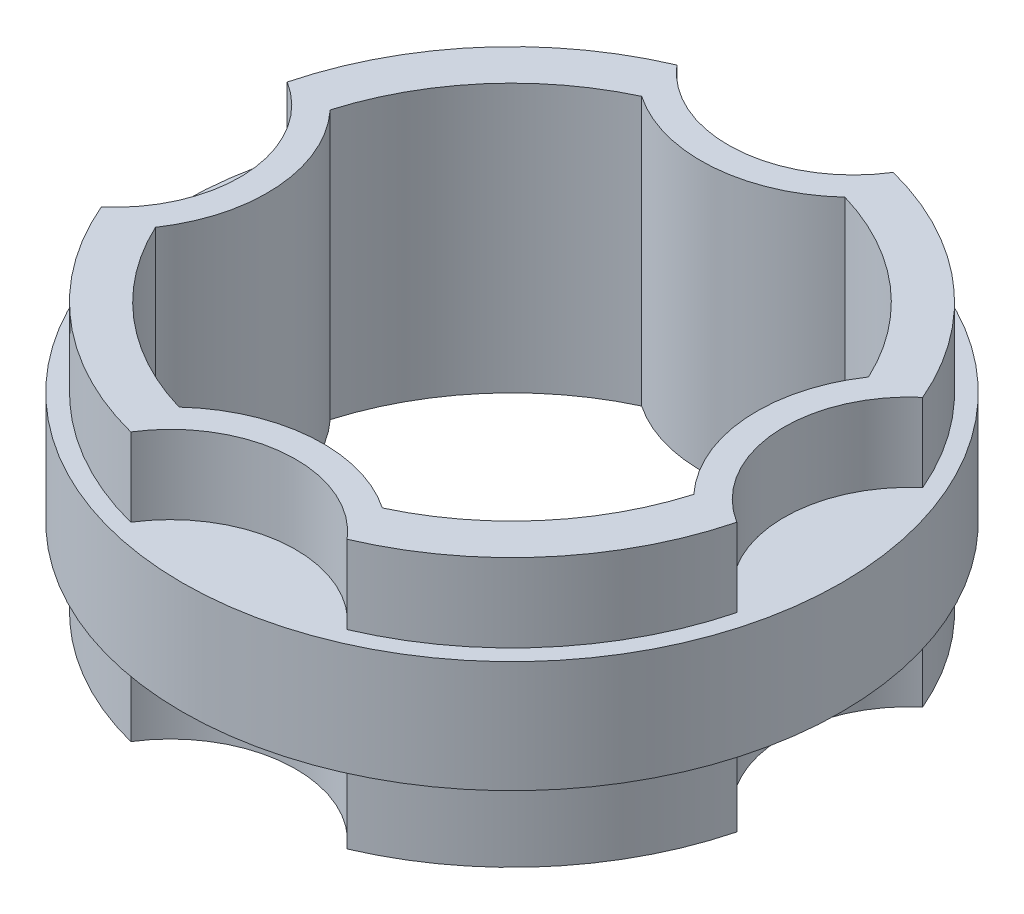
ISO-10303-21;
HEADER;
FILE_DESCRIPTION(('STEP AP214'),'2;1');
FILE_NAME('part.step','',(''),(''),'','','');
FILE_SCHEMA(('AUTOMOTIVE_DESIGN { 1 0 10303 214 1 1 1 1 }'));
ENDSEC;
DATA;
#1=APPLICATION_CONTEXT('core data for automotive mechanical design processes');
#2=APPLICATION_PROTOCOL_DEFINITION('international standard','automotive_design',2000,#1);
#3=PRODUCT_CONTEXT('',#1,'mechanical');
#4=PRODUCT('Part','Part','',(#3));
#5=PRODUCT_RELATED_PRODUCT_CATEGORY('part','',(#4));
#6=PRODUCT_DEFINITION_FORMATION('','',#4);
#7=PRODUCT_DEFINITION_CONTEXT('part definition',#1,'design');
#8=PRODUCT_DEFINITION('design','',#6,#7);
#9=PRODUCT_DEFINITION_SHAPE('','',#8);
#10=(LENGTH_UNIT() NAMED_UNIT(*) SI_UNIT(.MILLI.,.METRE.));
#11=(NAMED_UNIT(*) PLANE_ANGLE_UNIT() SI_UNIT($,.RADIAN.));
#12=(NAMED_UNIT(*) SI_UNIT($,.STERADIAN.) SOLID_ANGLE_UNIT());
#13=UNCERTAINTY_MEASURE_WITH_UNIT(LENGTH_MEASURE(1.E-05),#10,'distance_accuracy_value','');
#14=(GEOMETRIC_REPRESENTATION_CONTEXT(3) GLOBAL_UNCERTAINTY_ASSIGNED_CONTEXT((#13)) GLOBAL_UNIT_ASSIGNED_CONTEXT((#10,
#11,#12)) REPRESENTATION_CONTEXT('',''));
#15=CARTESIAN_POINT('',(0.,0.,0.));
#16=DIRECTION('',(0.,0.,1.));
#17=DIRECTION('',(1.,0.,0.));
#18=AXIS2_PLACEMENT_3D('',#15,#16,#17);
#19=CARTESIAN_POINT('',(104.92721593541,-44.5241872410913,-7.94005837170104));
#20=DIRECTION('',(0.,1.,0.));
#21=DIRECTION('',(0.,0.,1.));
#22=AXIS2_PLACEMENT_3D('',#19,#20,#21);
#23=CYLINDRICAL_SURFACE('',#22,35.5704838142581);
#24=CARTESIAN_POINT('',(104.92721593541,15.875,-7.94005837170104));
#25=DIRECTION('',(0.,1.,0.));
#26=DIRECTION('',(0.,0.,1.));
#27=AXIS2_PLACEMENT_3D('',#24,#25,#26);
#28=CIRCLE('',#27,35.5704838142581);
#29=CARTESIAN_POINT('',(86.0770548694598,15.875,22.225));
#30=VERTEX_POINT('',#29);
#31=CARTESIAN_POINT('',(81.7523967538567,15.875,-34.925));
#32=VERTEX_POINT('',#31);
#33=EDGE_CURVE('E294',#30,#32,#28,.F.);
#34=ORIENTED_EDGE('',*,*,#33,.T.);
#35=DIRECTION('',(0.,1.,0.));
#36=VECTOR('',#35,1.);
#37=CARTESIAN_POINT('',(81.7523967538567,-44.5241872410913,-34.925));
#38=LINE('',#37,#36);
#39=CARTESIAN_POINT('',(81.7523967538567,38.1,-34.925));
#40=VERTEX_POINT('',#39);
#41=EDGE_CURVE('E260',#32,#40,#38,.T.);
#42=ORIENTED_EDGE('',*,*,#41,.T.);
#43=CARTESIAN_POINT('',(104.92721593541,38.1,-7.94005837170104));
#44=DIRECTION('',(0.,1.,0.));
#45=DIRECTION('',(0.,0.,1.));
#46=AXIS2_PLACEMENT_3D('',#43,#44,#45);
#47=CIRCLE('',#46,35.5704838142581);
#48=CARTESIAN_POINT('',(86.0770548694598,38.1,22.225));
#49=VERTEX_POINT('',#48);
#50=EDGE_CURVE('E262',#40,#49,#47,.T.);
#51=ORIENTED_EDGE('',*,*,#50,.T.);
#52=DIRECTION('',(0.,1.,0.));
#53=VECTOR('',#52,1.);
#54=CARTESIAN_POINT('',(86.0770548694598,-44.5241872410913,22.225));
#55=LINE('',#54,#53);
#56=EDGE_CURVE('E257',#30,#49,#55,.T.);
#57=ORIENTED_EDGE('',*,*,#56,.F.);
#58=EDGE_LOOP('',(#34,#42,#51,#57));
#59=FACE_BOUND('',#58,.T.);
#60=ADVANCED_FACE('F34',(#59),#23,.F.);
#61=DIRECTION('',(0.,-1.,0.));
#62=VECTOR('',#61,1.);
#63=CARTESIAN_POINT('',(81.7523967538567,76.2741872410913,-34.925));
#64=LINE('',#63,#62);
#65=CARTESIAN_POINT('',(81.7523967538567,-15.875,-34.925));
#66=VERTEX_POINT('',#65);
#67=CARTESIAN_POINT('',(81.7523967538567,-38.1,-34.925));
#68=VERTEX_POINT('',#67);
#69=EDGE_CURVE('E321',#66,#68,#64,.T.);
#70=ORIENTED_EDGE('',*,*,#69,.F.);
#71=CARTESIAN_POINT('',(104.92721593541,-15.875,-7.94005837170104));
#72=DIRECTION('',(0.,1.,0.));
#73=DIRECTION('',(0.,0.,1.));
#74=AXIS2_PLACEMENT_3D('',#71,#72,#73);
#75=CIRCLE('',#74,35.5704838142581);
#76=CARTESIAN_POINT('',(86.0770548694598,-15.875,22.225));
#77=VERTEX_POINT('',#76);
#78=EDGE_CURVE('E333',#77,#66,#75,.F.);
#79=ORIENTED_EDGE('',*,*,#78,.F.);
#80=DIRECTION('',(0.,-1.,0.));
#81=VECTOR('',#80,1.);
#82=CARTESIAN_POINT('',(86.0770548694598,76.2741872410913,22.225));
#83=LINE('',#82,#81);
#84=CARTESIAN_POINT('',(86.0770548694598,-38.1,22.225));
#85=VERTEX_POINT('',#84);
#86=EDGE_CURVE('E318',#77,#85,#83,.T.);
#87=ORIENTED_EDGE('',*,*,#86,.T.);
#88=CARTESIAN_POINT('',(104.92721593541,-38.1,-7.94005837170104));
#89=DIRECTION('',(0.,1.,0.));
#90=DIRECTION('',(0.,0.,1.));
#91=AXIS2_PLACEMENT_3D('',#88,#89,#90);
#92=CIRCLE('',#91,35.5704838142581);
#93=EDGE_CURVE('E275',#68,#85,#92,.T.);
#94=ORIENTED_EDGE('',*,*,#93,.F.);
#95=EDGE_LOOP('',(#70,#79,#87,#94));
#96=FACE_BOUND('',#95,.T.);
#97=ADVANCED_FACE('F397',(#96),#23,.F.);
#98=CARTESIAN_POINT('',(-7.94005837169994,-44.5241872410913,-104.92721593541));
#99=DIRECTION('',(0.,1.,0.));
#100=DIRECTION('',(0.,0.,1.));
#101=AXIS2_PLACEMENT_3D('',#98,#99,#100);
#102=CYLINDRICAL_SURFACE('',#101,35.5704838142581);
#103=CARTESIAN_POINT('',(-7.94005837169994,15.875,-104.92721593541));
#104=DIRECTION('',(0.,1.,0.));
#105=DIRECTION('',(0.,0.,1.));
#106=AXIS2_PLACEMENT_3D('',#103,#104,#105);
#107=CIRCLE('',#106,35.5704838142581);
#108=CARTESIAN_POINT('',(22.2250000000009,15.875,-86.0770548694596));
#109=VERTEX_POINT('',#108);
#110=CARTESIAN_POINT('',(-34.9249999999991,15.875,-81.7523967538571));
#111=VERTEX_POINT('',#110);
#112=EDGE_CURVE('E327',#109,#111,#107,.F.);
#113=ORIENTED_EDGE('',*,*,#112,.T.);
#114=DIRECTION('',(0.,1.,0.));
#115=VECTOR('',#114,1.);
#116=CARTESIAN_POINT('',(-34.9249999999991,-44.5241872410913,-81.7523967538571));
#117=LINE('',#116,#115);
#118=CARTESIAN_POINT('',(-34.9249999999991,38.1,-81.7523967538571));
#119=VERTEX_POINT('',#118);
#120=EDGE_CURVE('E267',#111,#119,#117,.T.);
#121=ORIENTED_EDGE('',*,*,#120,.T.);
#122=CARTESIAN_POINT('',(-7.94005837169994,38.1,-104.92721593541));
#123=DIRECTION('',(0.,1.,0.));
#124=DIRECTION('',(1.,0.,0.));
#125=AXIS2_PLACEMENT_3D('',#122,#123,#124);
#126=CIRCLE('',#125,35.5704838142581);
#127=CARTESIAN_POINT('',(22.2250000000009,38.1,-86.0770548694596));
#128=VERTEX_POINT('',#127);
#129=EDGE_CURVE('E270',#119,#128,#126,.T.);
#130=ORIENTED_EDGE('',*,*,#129,.T.);
#131=DIRECTION('',(0.,1.,0.));
#132=VECTOR('',#131,1.);
#133=CARTESIAN_POINT('',(22.2250000000009,-44.5241872410913,-86.0770548694596));
#134=LINE('',#133,#132);
#135=EDGE_CURVE('E269',#109,#128,#134,.T.);
#136=ORIENTED_EDGE('',*,*,#135,.F.);
#137=EDGE_LOOP('',(#113,#121,#130,#136));
#138=FACE_BOUND('',#137,.T.);
#139=ADVANCED_FACE('F403',(#138),#102,.F.);
#140=DIRECTION('',(0.,-1.,0.));
#141=VECTOR('',#140,1.);
#142=CARTESIAN_POINT('',(-34.9249999999991,76.2741872410913,-81.7523967538571));
#143=LINE('',#142,#141);
#144=CARTESIAN_POINT('',(-34.9249999999991,-15.875,-81.7523967538571));
#145=VERTEX_POINT('',#144);
#146=CARTESIAN_POINT('',(-34.9249999999991,-38.1,-81.7523967538571));
#147=VERTEX_POINT('',#146);
#148=EDGE_CURVE('E293',#145,#147,#143,.T.);
#149=ORIENTED_EDGE('',*,*,#148,.F.);
#150=CARTESIAN_POINT('',(-7.94005837169994,-15.875,-104.92721593541));
#151=DIRECTION('',(0.,1.,0.));
#152=DIRECTION('',(0.,0.,1.));
#153=AXIS2_PLACEMENT_3D('',#150,#151,#152);
#154=CIRCLE('',#153,35.5704838142581);
#155=CARTESIAN_POINT('',(22.2250000000009,-15.875,-86.0770548694596));
#156=VERTEX_POINT('',#155);
#157=EDGE_CURVE('E335',#156,#145,#154,.F.);
#158=ORIENTED_EDGE('',*,*,#157,.F.);
#159=DIRECTION('',(0.,-1.,0.));
#160=VECTOR('',#159,1.);
#161=CARTESIAN_POINT('',(22.2250000000009,76.2741872410913,-86.0770548694596));
#162=LINE('',#161,#160);
#163=CARTESIAN_POINT('',(22.2250000000009,-38.1,-86.0770548694596));
#164=VERTEX_POINT('',#163);
#165=EDGE_CURVE('E290',#156,#164,#162,.T.);
#166=ORIENTED_EDGE('',*,*,#165,.T.);
#167=CARTESIAN_POINT('',(-7.94005837169994,-38.1,-104.92721593541));
#168=DIRECTION('',(0.,1.,0.));
#169=DIRECTION('',(1.,0.,0.));
#170=AXIS2_PLACEMENT_3D('',#167,#168,#169);
#171=CIRCLE('',#170,35.5704838142581);
#172=EDGE_CURVE('E297',#147,#164,#171,.T.);
#173=ORIENTED_EDGE('',*,*,#172,.F.);
#174=EDGE_LOOP('',(#149,#158,#166,#173));
#175=FACE_BOUND('',#174,.T.);
#176=ADVANCED_FACE('F490',(#175),#102,.F.);
#177=CARTESIAN_POINT('',(-104.92721593541,-44.5241872410913,7.94005837170104));
#178=DIRECTION('',(0.,1.,0.));
#179=DIRECTION('',(0.,0.,1.));
#180=AXIS2_PLACEMENT_3D('',#177,#178,#179);
#181=CYLINDRICAL_SURFACE('',#180,35.5704838142581);
#182=CARTESIAN_POINT('',(-104.92721593541,15.875,7.94005837170104));
#183=DIRECTION('',(0.,1.,0.));
#184=DIRECTION('',(0.,0.,1.));
#185=AXIS2_PLACEMENT_3D('',#182,#183,#184);
#186=CIRCLE('',#185,35.5704838142581);
#187=CARTESIAN_POINT('',(-86.0770548694598,15.875,-22.225));
#188=VERTEX_POINT('',#187);
#189=CARTESIAN_POINT('',(-81.7523967538567,15.875,34.925));
#190=VERTEX_POINT('',#189);
#191=EDGE_CURVE('E329',#188,#190,#186,.F.);
#192=ORIENTED_EDGE('',*,*,#191,.T.);
#193=DIRECTION('',(0.,1.,0.));
#194=VECTOR('',#193,1.);
#195=CARTESIAN_POINT('',(-81.7523967538567,-44.5241872410913,34.925));
#196=LINE('',#195,#194);
#197=CARTESIAN_POINT('',(-81.7523967538567,38.1,34.925));
#198=VERTEX_POINT('',#197);
#199=EDGE_CURVE('E276',#190,#198,#196,.T.);
#200=ORIENTED_EDGE('',*,*,#199,.T.);
#201=CARTESIAN_POINT('',(-104.92721593541,38.1,7.94005837170104));
#202=DIRECTION('',(0.,1.,0.));
#203=DIRECTION('',(0.,0.,-1.));
#204=AXIS2_PLACEMENT_3D('',#201,#202,#203);
#205=CIRCLE('',#204,35.5704838142581);
#206=CARTESIAN_POINT('',(-86.0770548694598,38.1,-22.225));
#207=VERTEX_POINT('',#206);
#208=EDGE_CURVE('E272',#198,#207,#205,.T.);
#209=ORIENTED_EDGE('',*,*,#208,.T.);
#210=DIRECTION('',(0.,1.,0.));
#211=VECTOR('',#210,1.);
#212=CARTESIAN_POINT('',(-86.0770548694598,-44.5241872410913,-22.225));
#213=LINE('',#212,#211);
#214=EDGE_CURVE('E278',#188,#207,#213,.T.);
#215=ORIENTED_EDGE('',*,*,#214,.F.);
#216=EDGE_LOOP('',(#192,#200,#209,#215));
#217=FACE_BOUND('',#216,.T.);
#218=ADVANCED_FACE('F488',(#217),#181,.F.);
#219=DIRECTION('',(0.,-1.,0.));
#220=VECTOR('',#219,1.);
#221=CARTESIAN_POINT('',(-81.7523967538567,76.2741872410913,34.925));
#222=LINE('',#221,#220);
#223=CARTESIAN_POINT('',(-81.7523967538567,-15.875,34.925));
#224=VERTEX_POINT('',#223);
#225=CARTESIAN_POINT('',(-81.7523967538567,-38.1,34.925));
#226=VERTEX_POINT('',#225);
#227=EDGE_CURVE('E303',#224,#226,#222,.T.);
#228=ORIENTED_EDGE('',*,*,#227,.F.);
#229=CARTESIAN_POINT('',(-104.92721593541,-15.875,7.94005837170104));
#230=DIRECTION('',(0.,1.,0.));
#231=DIRECTION('',(0.,0.,1.));
#232=AXIS2_PLACEMENT_3D('',#229,#230,#231);
#233=CIRCLE('',#232,35.5704838142581);
#234=CARTESIAN_POINT('',(-86.0770548694598,-15.875,-22.225));
#235=VERTEX_POINT('',#234);
#236=EDGE_CURVE('E337',#235,#224,#233,.F.);
#237=ORIENTED_EDGE('',*,*,#236,.F.);
#238=DIRECTION('',(0.,-1.,0.));
#239=VECTOR('',#238,1.);
#240=CARTESIAN_POINT('',(-86.0770548694598,76.2741872410913,-22.225));
#241=LINE('',#240,#239);
#242=CARTESIAN_POINT('',(-86.0770548694598,-38.1,-22.225));
#243=VERTEX_POINT('',#242);
#244=EDGE_CURVE('E300',#235,#243,#241,.T.);
#245=ORIENTED_EDGE('',*,*,#244,.T.);
#246=CARTESIAN_POINT('',(-104.92721593541,-38.1,7.94005837170104));
#247=DIRECTION('',(0.,1.,0.));
#248=DIRECTION('',(0.,0.,-1.));
#249=AXIS2_PLACEMENT_3D('',#246,#247,#248);
#250=CIRCLE('',#249,35.5704838142581);
#251=EDGE_CURVE('E306',#226,#243,#250,.T.);
#252=ORIENTED_EDGE('',*,*,#251,.F.);
#253=EDGE_LOOP('',(#228,#237,#245,#252));
#254=FACE_BOUND('',#253,.T.);
#255=ADVANCED_FACE('F447',(#254),#181,.F.);
#256=CARTESIAN_POINT('',(7.94005837170067,-44.5241872410913,104.92721593541));
#257=DIRECTION('',(0.,1.,0.));
#258=DIRECTION('',(0.,0.,1.));
#259=AXIS2_PLACEMENT_3D('',#256,#257,#258);
#260=CYLINDRICAL_SURFACE('',#259,35.5704838142581);
#261=DIRECTION('',(0.,1.,0.));
#262=VECTOR('',#261,1.);
#263=CARTESIAN_POINT('',(-22.2250000000003,-44.5241872410913,86.0770548694597));
#264=LINE('',#263,#262);
#265=CARTESIAN_POINT('',(-22.2250000000003,15.875,86.0770548694597));
#266=VERTEX_POINT('',#265);
#267=CARTESIAN_POINT('',(-22.2250000000003,38.1,86.0770548694597));
#268=VERTEX_POINT('',#267);
#269=EDGE_CURVE('E266',#266,#268,#264,.T.);
#270=ORIENTED_EDGE('',*,*,#269,.F.);
#271=CARTESIAN_POINT('',(7.94005837170067,15.875,104.92721593541));
#272=DIRECTION('',(0.,1.,0.));
#273=DIRECTION('',(0.,0.,1.));
#274=AXIS2_PLACEMENT_3D('',#271,#272,#273);
#275=CIRCLE('',#274,35.5704838142581);
#276=CARTESIAN_POINT('',(34.9249999999997,15.875,81.7523967538568));
#277=VERTEX_POINT('',#276);
#278=EDGE_CURVE('E331',#266,#277,#275,.F.);
#279=ORIENTED_EDGE('',*,*,#278,.T.);
#280=DIRECTION('',(0.,1.,0.));
#281=VECTOR('',#280,1.);
#282=CARTESIAN_POINT('',(34.9249999999997,-44.5241872410913,81.7523967538568));
#283=LINE('',#282,#281);
#284=CARTESIAN_POINT('',(34.9249999999997,38.1,81.7523967538568));
#285=VERTEX_POINT('',#284);
#286=EDGE_CURVE('E284',#277,#285,#283,.T.);
#287=ORIENTED_EDGE('',*,*,#286,.T.);
#288=CARTESIAN_POINT('',(7.94005837170067,38.1,104.92721593541));
#289=DIRECTION('',(0.,1.,0.));
#290=DIRECTION('',(-1.,0.,0.));
#291=AXIS2_PLACEMENT_3D('',#288,#289,#290);
#292=CIRCLE('',#291,35.5704838142581);
#293=EDGE_CURVE('E281',#285,#268,#292,.T.);
#294=ORIENTED_EDGE('',*,*,#293,.T.);
#295=EDGE_LOOP('',(#270,#279,#287,#294));
#296=FACE_BOUND('',#295,.T.);
#297=ADVANCED_FACE('F474',(#296),#260,.F.);
#298=DIRECTION('',(0.,-1.,0.));
#299=VECTOR('',#298,1.);
#300=CARTESIAN_POINT('',(34.9249999999997,76.2741872410913,81.7523967538568));
#301=LINE('',#300,#299);
#302=CARTESIAN_POINT('',(34.9249999999997,-15.875,81.7523967538568));
#303=VERTEX_POINT('',#302);
#304=CARTESIAN_POINT('',(34.9249999999997,-38.1,81.7523967538568));
#305=VERTEX_POINT('',#304);
#306=EDGE_CURVE('E312',#303,#305,#301,.T.);
#307=ORIENTED_EDGE('',*,*,#306,.F.);
#308=CARTESIAN_POINT('',(7.94005837170067,-15.875,104.92721593541));
#309=DIRECTION('',(0.,1.,0.));
#310=DIRECTION('',(0.,0.,1.));
#311=AXIS2_PLACEMENT_3D('',#308,#309,#310);
#312=CIRCLE('',#311,35.5704838142581);
#313=CARTESIAN_POINT('',(-22.2250000000003,-15.875,86.0770548694597));
#314=VERTEX_POINT('',#313);
#315=EDGE_CURVE('E339',#314,#303,#312,.F.);
#316=ORIENTED_EDGE('',*,*,#315,.F.);
#317=DIRECTION('',(0.,-1.,0.));
#318=VECTOR('',#317,1.);
#319=CARTESIAN_POINT('',(-22.2250000000003,76.2741872410913,86.0770548694597));
#320=LINE('',#319,#318);
#321=CARTESIAN_POINT('',(-22.2250000000003,-38.1,86.0770548694597));
#322=VERTEX_POINT('',#321);
#323=EDGE_CURVE('E309',#314,#322,#320,.T.);
#324=ORIENTED_EDGE('',*,*,#323,.T.);
#325=CARTESIAN_POINT('',(7.94005837170067,-38.1,104.92721593541));
#326=DIRECTION('',(0.,1.,0.));
#327=DIRECTION('',(-1.,0.,0.));
#328=AXIS2_PLACEMENT_3D('',#325,#326,#327);
#329=CIRCLE('',#328,35.5704838142581);
#330=EDGE_CURVE('E315',#305,#322,#329,.T.);
#331=ORIENTED_EDGE('',*,*,#330,.F.);
#332=EDGE_LOOP('',(#307,#316,#324,#331));
#333=FACE_BOUND('',#332,.T.);
#334=ADVANCED_FACE('F423',(#333),#260,.F.);
#335=CARTESIAN_POINT('',(0.,38.1,0.));
#336=DIRECTION('',(0.,-1.,0.));
#337=DIRECTION('',(0.,0.,-1.));
#338=AXIS2_PLACEMENT_3D('',#335,#336,#337);
#339=CYLINDRICAL_SURFACE('',#338,76.2);
#340=CARTESIAN_POINT('',(0.,38.1,0.));
#341=DIRECTION('',(0.,1.,0.));
#342=DIRECTION('',(0.,0.,1.));
#343=AXIS2_PLACEMENT_3D('',#340,#341,#342);
#344=CIRCLE('',#343,76.2);
#345=CARTESIAN_POINT('',(32.221294795127,38.1,69.0523581184996));
#346=VERTEX_POINT('',#345);
#347=CARTESIAN_POINT('',(73.1147754744554,38.1,21.4632152139417));
#348=VERTEX_POINT('',#347);
#349=EDGE_CURVE('E222',#346,#348,#344,.T.);
#350=ORIENTED_EDGE('',*,*,#349,.T.);
#351=DIRECTION('',(0.,-1.,0.));
#352=VECTOR('',#351,1.);
#353=CARTESIAN_POINT('',(73.1147754744554,0.,21.4632152139417));
#354=LINE('',#353,#352);
#355=CARTESIAN_POINT('',(73.1147754744554,-38.1,21.4632152139417));
#356=VERTEX_POINT('',#355);
#357=EDGE_CURVE('E201',#348,#356,#354,.T.);
#358=ORIENTED_EDGE('',*,*,#357,.T.);
#359=CARTESIAN_POINT('',(0.,-38.1,0.));
#360=DIRECTION('',(0.,1.,0.));
#361=DIRECTION('',(0.,0.,1.));
#362=AXIS2_PLACEMENT_3D('',#359,#360,#361);
#363=CIRCLE('',#362,76.2);
#364=CARTESIAN_POINT('',(32.221294795127,-38.1,69.0523581184996));
#365=VERTEX_POINT('',#364);
#366=EDGE_CURVE('E227',#365,#356,#363,.T.);
#367=ORIENTED_EDGE('',*,*,#366,.F.);
#368=DIRECTION('',(0.,-1.,0.));
#369=VECTOR('',#368,1.);
#370=CARTESIAN_POINT('',(32.221294795127,0.,69.0523581184996));
#371=LINE('',#370,#369);
#372=EDGE_CURVE('E344',#365,#346,#371,.F.);
#373=ORIENTED_EDGE('',*,*,#372,.T.);
#374=EDGE_LOOP('',(#350,#358,#367,#373));
#375=FACE_BOUND('',#374,.T.);
#376=ADVANCED_FACE('F371',(#375),#339,.F.);
#377=CARTESIAN_POINT('',(69.0523581185,-38.1,-32.2212947951263));
#378=VERTEX_POINT('',#377);
#379=CARTESIAN_POINT('',(21.463215213941,-38.1,-73.1147754744556));
#380=VERTEX_POINT('',#379);
#381=EDGE_CURVE('E212',#378,#380,#363,.T.);
#382=ORIENTED_EDGE('',*,*,#381,.F.);
#383=DIRECTION('',(0.,-1.,0.));
#384=VECTOR('',#383,1.);
#385=CARTESIAN_POINT('',(69.0523581185,0.,-32.2212947951263));
#386=LINE('',#385,#384);
#387=CARTESIAN_POINT('',(69.0523581185,38.1,-32.2212947951263));
#388=VERTEX_POINT('',#387);
#389=EDGE_CURVE('E198',#378,#388,#386,.F.);
#390=ORIENTED_EDGE('',*,*,#389,.T.);
#391=CARTESIAN_POINT('',(21.463215213941,38.1,-73.1147754744556));
#392=VERTEX_POINT('',#391);
#393=EDGE_CURVE('E210',#388,#392,#344,.T.);
#394=ORIENTED_EDGE('',*,*,#393,.T.);
#395=DIRECTION('',(0.,-1.,0.));
#396=VECTOR('',#395,1.);
#397=CARTESIAN_POINT('',(21.463215213941,0.,-73.1147754744556));
#398=LINE('',#397,#396);
#399=EDGE_CURVE('E361',#392,#380,#398,.T.);
#400=ORIENTED_EDGE('',*,*,#399,.T.);
#401=EDGE_LOOP('',(#382,#390,#394,#400));
#402=FACE_BOUND('',#401,.T.);
#403=ADVANCED_FACE('F208',(#402),#339,.F.);
#404=CARTESIAN_POINT('',(-32.221294795127,-38.1,-69.0523581184996));
#405=VERTEX_POINT('',#404);
#406=CARTESIAN_POINT('',(-73.1147754744555,-38.1,-21.4632152139412));
#407=VERTEX_POINT('',#406);
#408=EDGE_CURVE('E232',#405,#407,#363,.T.);
#409=ORIENTED_EDGE('',*,*,#408,.F.);
#410=DIRECTION('',(0.,-1.,0.));
#411=VECTOR('',#410,1.);
#412=CARTESIAN_POINT('',(-32.221294795127,0.,-69.0523581184996));
#413=LINE('',#412,#411);
#414=CARTESIAN_POINT('',(-32.221294795127,38.1,-69.0523581184996));
#415=VERTEX_POINT('',#414);
#416=EDGE_CURVE('E365',#405,#415,#413,.F.);
#417=ORIENTED_EDGE('',*,*,#416,.T.);
#418=CARTESIAN_POINT('',(-73.1147754744555,38.1,-21.4632152139412));
#419=VERTEX_POINT('',#418);
#420=EDGE_CURVE('E220',#415,#419,#344,.T.);
#421=ORIENTED_EDGE('',*,*,#420,.T.);
#422=DIRECTION('',(0.,-1.,0.));
#423=VECTOR('',#422,1.);
#424=CARTESIAN_POINT('',(-73.1147754744555,0.,-21.4632152139412));
#425=LINE('',#424,#423);
#426=EDGE_CURVE('E349',#419,#407,#425,.T.);
#427=ORIENTED_EDGE('',*,*,#426,.T.);
#428=EDGE_LOOP('',(#409,#417,#421,#427));
#429=FACE_BOUND('',#428,.T.);
#430=ADVANCED_FACE('F385',(#429),#339,.F.);
#431=CARTESIAN_POINT('',(-69.0523581184998,-38.1,32.2212947951267));
#432=VERTEX_POINT('',#431);
#433=CARTESIAN_POINT('',(-21.463215213941,-38.1,73.1147754744556));
#434=VERTEX_POINT('',#433);
#435=EDGE_CURVE('E230',#432,#434,#363,.T.);
#436=ORIENTED_EDGE('',*,*,#435,.F.);
#437=DIRECTION('',(0.,-1.,0.));
#438=VECTOR('',#437,1.);
#439=CARTESIAN_POINT('',(-69.0523581184997,0.,32.2212947951268));
#440=LINE('',#439,#438);
#441=CARTESIAN_POINT('',(-69.0523581184997,38.1,32.2212947951268));
#442=VERTEX_POINT('',#441);
#443=EDGE_CURVE('E354',#432,#442,#440,.F.);
#444=ORIENTED_EDGE('',*,*,#443,.T.);
#445=CARTESIAN_POINT('',(-21.463215213941,38.1,73.1147754744556));
#446=VERTEX_POINT('',#445);
#447=EDGE_CURVE('E224',#442,#446,#344,.T.);
#448=ORIENTED_EDGE('',*,*,#447,.T.);
#449=DIRECTION('',(0.,-1.,0.));
#450=VECTOR('',#449,1.);
#451=CARTESIAN_POINT('',(-21.463215213941,0.,73.1147754744556));
#452=LINE('',#451,#450);
#453=EDGE_CURVE('E341',#446,#434,#452,.T.);
#454=ORIENTED_EDGE('',*,*,#453,.T.);
#455=EDGE_LOOP('',(#436,#444,#448,#454));
#456=FACE_BOUND('',#455,.T.);
#457=ADVANCED_FACE('F378',(#456),#339,.F.);
#458=CARTESIAN_POINT('',(0.,38.1,0.));
#459=DIRECTION('',(0.,-1.,0.));
#460=DIRECTION('',(0.,0.,-1.));
#461=AXIS2_PLACEMENT_3D('',#458,#459,#460);
#462=CYLINDRICAL_SURFACE('',#461,88.9);
#463=ORIENTED_EDGE('',*,*,#86,.F.);
#464=CARTESIAN_POINT('',(0.,-15.875,0.));
#465=DIRECTION('',(0.,1.,0.));
#466=DIRECTION('',(0.,0.,1.));
#467=AXIS2_PLACEMENT_3D('',#464,#465,#466);
#468=CIRCLE('',#467,88.9);
#469=EDGE_CURVE('E11',#303,#77,#468,.T.);
#470=ORIENTED_EDGE('',*,*,#469,.F.);
#471=ORIENTED_EDGE('',*,*,#306,.T.);
#472=CARTESIAN_POINT('',(0.,-38.1,0.));
#473=DIRECTION('',(0.,1.,0.));
#474=DIRECTION('',(0.,0.,1.));
#475=AXIS2_PLACEMENT_3D('',#472,#473,#474);
#476=CIRCLE('',#475,88.9);
#477=EDGE_CURVE('E38',#305,#85,#476,.T.);
#478=ORIENTED_EDGE('',*,*,#477,.T.);
#479=EDGE_LOOP('',(#463,#470,#471,#478));
#480=FACE_BOUND('',#479,.T.);
#481=ADVANCED_FACE('F431',(#480),#462,.T.);
#482=EDGE_CURVE('E434',#68,#164,#476,.T.);
#483=ORIENTED_EDGE('',*,*,#482,.T.);
#484=ORIENTED_EDGE('',*,*,#165,.F.);
#485=EDGE_CURVE('E43',#66,#156,#468,.T.);
#486=ORIENTED_EDGE('',*,*,#485,.F.);
#487=ORIENTED_EDGE('',*,*,#69,.T.);
#488=EDGE_LOOP('',(#483,#484,#486,#487));
#489=FACE_BOUND('',#488,.T.);
#490=ADVANCED_FACE('F644',(#489),#462,.T.);
#491=EDGE_CURVE('E219',#226,#322,#476,.T.);
#492=ORIENTED_EDGE('',*,*,#491,.T.);
#493=ORIENTED_EDGE('',*,*,#323,.F.);
#494=EDGE_CURVE('E45',#224,#314,#468,.T.);
#495=ORIENTED_EDGE('',*,*,#494,.F.);
#496=ORIENTED_EDGE('',*,*,#227,.T.);
#497=EDGE_LOOP('',(#492,#493,#495,#496));
#498=FACE_BOUND('',#497,.T.);
#499=ADVANCED_FACE('F451',(#498),#462,.T.);
#500=EDGE_CURVE('E223',#147,#243,#476,.T.);
#501=ORIENTED_EDGE('',*,*,#500,.T.);
#502=ORIENTED_EDGE('',*,*,#244,.F.);
#503=EDGE_CURVE('E459',#145,#235,#468,.T.);
#504=ORIENTED_EDGE('',*,*,#503,.F.);
#505=ORIENTED_EDGE('',*,*,#148,.T.);
#506=EDGE_LOOP('',(#501,#502,#504,#505));
#507=FACE_BOUND('',#506,.T.);
#508=ADVANCED_FACE('F412',(#507),#462,.T.);
#509=CARTESIAN_POINT('',(0.,15.875,0.));
#510=DIRECTION('',(0.,1.,0.));
#511=DIRECTION('',(0.,0.,1.));
#512=AXIS2_PLACEMENT_3D('',#509,#510,#511);
#513=PLANE('',#512);
#514=CARTESIAN_POINT('',(0.,15.875,0.));
#515=DIRECTION('',(0.,1.,0.));
#516=DIRECTION('',(0.,0.,1.));
#517=AXIS2_PLACEMENT_3D('',#514,#515,#516);
#518=CIRCLE('',#517,93.6625);
#519=CARTESIAN_POINT('',(0.,15.875,93.6625));
#520=VERTEX_POINT('',#519);
#521=EDGE_CURVE('E244',#520,#520,#518,.T.);
#522=ORIENTED_EDGE('',*,*,#521,.T.);
#523=EDGE_LOOP('',(#522));
#524=FACE_BOUND('',#523,.T.);
#525=CARTESIAN_POINT('',(0.,15.875,0.));
#526=DIRECTION('',(0.,1.,0.));
#527=DIRECTION('',(0.,0.,1.));
#528=AXIS2_PLACEMENT_3D('',#525,#526,#527);
#529=CIRCLE('',#528,88.9);
#530=EDGE_CURVE('E233',#32,#109,#529,.T.);
#531=ORIENTED_EDGE('',*,*,#530,.F.);
#532=ORIENTED_EDGE('',*,*,#33,.F.);
#533=EDGE_CURVE('E237',#277,#30,#529,.T.);
#534=ORIENTED_EDGE('',*,*,#533,.F.);
#535=ORIENTED_EDGE('',*,*,#278,.F.);
#536=EDGE_CURVE('E243',#190,#266,#529,.T.);
#537=ORIENTED_EDGE('',*,*,#536,.F.);
#538=ORIENTED_EDGE('',*,*,#191,.F.);
#539=EDGE_CURVE('E236',#111,#188,#529,.T.);
#540=ORIENTED_EDGE('',*,*,#539,.F.);
#541=ORIENTED_EDGE('',*,*,#112,.F.);
#542=EDGE_LOOP('',(#531,#532,#534,#535,#537,#538,#540,#541));
#543=FACE_BOUND('',#542,.T.);
#544=ADVANCED_FACE('F408',(#524,#543),#513,.T.);
#545=ORIENTED_EDGE('',*,*,#536,.T.);
#546=ORIENTED_EDGE('',*,*,#269,.T.);
#547=CARTESIAN_POINT('',(0.,38.1,0.));
#548=DIRECTION('',(0.,1.,0.));
#549=DIRECTION('',(0.,0.,1.));
#550=AXIS2_PLACEMENT_3D('',#547,#548,#549);
#551=CIRCLE('',#550,88.9);
#552=EDGE_CURVE('E465',#198,#268,#551,.T.);
#553=ORIENTED_EDGE('',*,*,#552,.F.);
#554=ORIENTED_EDGE('',*,*,#199,.F.);
#555=EDGE_LOOP('',(#545,#546,#553,#554));
#556=FACE_BOUND('',#555,.T.);
#557=ADVANCED_FACE('F411',(#556),#462,.T.);
#558=ORIENTED_EDGE('',*,*,#539,.T.);
#559=ORIENTED_EDGE('',*,*,#214,.T.);
#560=EDGE_CURVE('E461',#119,#207,#551,.T.);
#561=ORIENTED_EDGE('',*,*,#560,.F.);
#562=ORIENTED_EDGE('',*,*,#120,.F.);
#563=EDGE_LOOP('',(#558,#559,#561,#562));
#564=FACE_BOUND('',#563,.T.);
#565=ADVANCED_FACE('F485',(#564),#462,.T.);
#566=ORIENTED_EDGE('',*,*,#530,.T.);
#567=ORIENTED_EDGE('',*,*,#135,.T.);
#568=EDGE_CURVE('E460',#40,#128,#551,.T.);
#569=ORIENTED_EDGE('',*,*,#568,.F.);
#570=ORIENTED_EDGE('',*,*,#41,.F.);
#571=EDGE_LOOP('',(#566,#567,#569,#570));
#572=FACE_BOUND('',#571,.T.);
#573=ADVANCED_FACE('F426',(#572),#462,.T.);
#574=CARTESIAN_POINT('',(0.,38.1,0.));
#575=DIRECTION('',(0.,1.,0.));
#576=DIRECTION('',(0.,0.,1.));
#577=AXIS2_PLACEMENT_3D('',#574,#575,#576);
#578=PLANE('',#577);
#579=ORIENTED_EDGE('',*,*,#393,.F.);
#580=CARTESIAN_POINT('',(104.92721593541,38.1,-7.94005837169957));
#581=DIRECTION('',(0.,1.,0.));
#582=DIRECTION('',(1.,0.,0.));
#583=AXIS2_PLACEMENT_3D('',#580,#581,#582);
#584=CIRCLE('',#583,43.3195552335648);
#585=EDGE_CURVE('E195',#388,#348,#584,.T.);
#586=ORIENTED_EDGE('',*,*,#585,.T.);
#587=ORIENTED_EDGE('',*,*,#349,.F.);
#588=CARTESIAN_POINT('',(7.94005837170067,38.1,104.92721593541));
#589=DIRECTION('',(0.,1.,0.));
#590=DIRECTION('',(0.,0.,1.));
#591=AXIS2_PLACEMENT_3D('',#588,#589,#590);
#592=CIRCLE('',#591,43.3195552335648);
#593=EDGE_CURVE('E346',#346,#446,#592,.T.);
#594=ORIENTED_EDGE('',*,*,#593,.T.);
#595=ORIENTED_EDGE('',*,*,#447,.F.);
#596=CARTESIAN_POINT('',(-104.92721593541,38.1,7.94005837170031));
#597=DIRECTION('',(0.,1.,0.));
#598=DIRECTION('',(-1.,0.,0.));
#599=AXIS2_PLACEMENT_3D('',#596,#597,#598);
#600=CIRCLE('',#599,43.3195552335648);
#601=EDGE_CURVE('E357',#442,#419,#600,.T.);
#602=ORIENTED_EDGE('',*,*,#601,.T.);
#603=ORIENTED_EDGE('',*,*,#420,.F.);
#604=CARTESIAN_POINT('',(-7.94005837170067,38.1,-104.92721593541));
#605=DIRECTION('',(0.,1.,0.));
#606=DIRECTION('',(0.,0.,-1.));
#607=AXIS2_PLACEMENT_3D('',#604,#605,#606);
#608=CIRCLE('',#607,43.3195552335648);
#609=EDGE_CURVE('E218',#415,#392,#608,.T.);
#610=ORIENTED_EDGE('',*,*,#609,.T.);
#611=EDGE_LOOP('',(#579,#586,#587,#594,#595,#602,#603,#610));
#612=FACE_BOUND('',#611,.T.);
#613=ORIENTED_EDGE('',*,*,#568,.T.);
#614=ORIENTED_EDGE('',*,*,#129,.F.);
#615=ORIENTED_EDGE('',*,*,#560,.T.);
#616=ORIENTED_EDGE('',*,*,#208,.F.);
#617=ORIENTED_EDGE('',*,*,#552,.T.);
#618=ORIENTED_EDGE('',*,*,#293,.F.);
#619=EDGE_CURVE('E439',#285,#49,#551,.T.);
#620=ORIENTED_EDGE('',*,*,#619,.T.);
#621=ORIENTED_EDGE('',*,*,#50,.F.);
#622=EDGE_LOOP('',(#613,#614,#615,#616,#617,#618,#620,#621));
#623=FACE_BOUND('',#622,.T.);
#624=ADVANCED_FACE('F215',(#612,#623),#578,.T.);
#625=CARTESIAN_POINT('',(0.,-38.1,0.));
#626=DIRECTION('',(0.,1.,0.));
#627=DIRECTION('',(0.,0.,1.));
#628=AXIS2_PLACEMENT_3D('',#625,#626,#627);
#629=PLANE('',#628);
#630=CARTESIAN_POINT('',(104.92721593541,-38.1,-7.94005837169957));
#631=DIRECTION('',(0.,1.,0.));
#632=DIRECTION('',(1.,0.,0.));
#633=AXIS2_PLACEMENT_3D('',#630,#631,#632);
#634=CIRCLE('',#633,43.3195552335648);
#635=EDGE_CURVE('E52',#378,#356,#634,.T.);
#636=ORIENTED_EDGE('',*,*,#635,.F.);
#637=ORIENTED_EDGE('',*,*,#381,.T.);
#638=CARTESIAN_POINT('',(-7.94005837170067,-38.1,-104.92721593541));
#639=DIRECTION('',(0.,1.,0.));
#640=DIRECTION('',(0.,0.,-1.));
#641=AXIS2_PLACEMENT_3D('',#638,#639,#640);
#642=CIRCLE('',#641,43.3195552335648);
#643=EDGE_CURVE('E58',#405,#380,#642,.T.);
#644=ORIENTED_EDGE('',*,*,#643,.F.);
#645=ORIENTED_EDGE('',*,*,#408,.T.);
#646=CARTESIAN_POINT('',(-104.92721593541,-38.1,7.94005837170031));
#647=DIRECTION('',(0.,1.,0.));
#648=DIRECTION('',(-1.,0.,0.));
#649=AXIS2_PLACEMENT_3D('',#646,#647,#648);
#650=CIRCLE('',#649,43.3195552335648);
#651=EDGE_CURVE('E358',#432,#407,#650,.T.);
#652=ORIENTED_EDGE('',*,*,#651,.F.);
#653=ORIENTED_EDGE('',*,*,#435,.T.);
#654=CARTESIAN_POINT('',(7.94005837170067,-38.1,104.92721593541));
#655=DIRECTION('',(0.,1.,0.));
#656=DIRECTION('',(0.,0.,1.));
#657=AXIS2_PLACEMENT_3D('',#654,#655,#656);
#658=CIRCLE('',#657,43.3195552335648);
#659=EDGE_CURVE('E347',#365,#434,#658,.T.);
#660=ORIENTED_EDGE('',*,*,#659,.F.);
#661=ORIENTED_EDGE('',*,*,#366,.T.);
#662=EDGE_LOOP('',(#636,#637,#644,#645,#652,#653,#660,#661));
#663=FACE_BOUND('',#662,.T.);
#664=ORIENTED_EDGE('',*,*,#482,.F.);
#665=ORIENTED_EDGE('',*,*,#93,.T.);
#666=ORIENTED_EDGE('',*,*,#477,.F.);
#667=ORIENTED_EDGE('',*,*,#330,.T.);
#668=ORIENTED_EDGE('',*,*,#491,.F.);
#669=ORIENTED_EDGE('',*,*,#251,.T.);
#670=ORIENTED_EDGE('',*,*,#500,.F.);
#671=ORIENTED_EDGE('',*,*,#172,.T.);
#672=EDGE_LOOP('',(#664,#665,#666,#667,#668,#669,#670,#671));
#673=FACE_BOUND('',#672,.T.);
#674=ADVANCED_FACE('F425',(#663,#673),#629,.F.);
#675=ORIENTED_EDGE('',*,*,#56,.T.);
#676=ORIENTED_EDGE('',*,*,#619,.F.);
#677=ORIENTED_EDGE('',*,*,#286,.F.);
#678=ORIENTED_EDGE('',*,*,#533,.T.);
#679=EDGE_LOOP('',(#675,#676,#677,#678));
#680=FACE_BOUND('',#679,.T.);
#681=ADVANCED_FACE('F36',(#680),#462,.T.);
#682=CARTESIAN_POINT('',(0.,-15.875,0.));
#683=DIRECTION('',(0.,1.,0.));
#684=DIRECTION('',(0.,0.,1.));
#685=AXIS2_PLACEMENT_3D('',#682,#683,#684);
#686=PLANE('',#685);
#687=CARTESIAN_POINT('',(0.,-15.875,0.));
#688=DIRECTION('',(0.,1.,0.));
#689=DIRECTION('',(0.,0.,1.));
#690=AXIS2_PLACEMENT_3D('',#687,#688,#689);
#691=CIRCLE('',#690,93.6625);
#692=CARTESIAN_POINT('',(0.,-15.875,93.6625));
#693=VERTEX_POINT('',#692);
#694=EDGE_CURVE('E252',#693,#693,#691,.T.);
#695=ORIENTED_EDGE('',*,*,#694,.F.);
#696=EDGE_LOOP('',(#695));
#697=FACE_BOUND('',#696,.T.);
#698=ORIENTED_EDGE('',*,*,#469,.T.);
#699=ORIENTED_EDGE('',*,*,#78,.T.);
#700=ORIENTED_EDGE('',*,*,#485,.T.);
#701=ORIENTED_EDGE('',*,*,#157,.T.);
#702=ORIENTED_EDGE('',*,*,#503,.T.);
#703=ORIENTED_EDGE('',*,*,#236,.T.);
#704=ORIENTED_EDGE('',*,*,#494,.T.);
#705=ORIENTED_EDGE('',*,*,#315,.T.);
#706=EDGE_LOOP('',(#698,#699,#700,#701,#702,#703,#704,#705));
#707=FACE_BOUND('',#706,.T.);
#708=ADVANCED_FACE('F413',(#697,#707),#686,.F.);
#709=CARTESIAN_POINT('',(0.,15.875,0.));
#710=DIRECTION('',(0.,-1.,0.));
#711=DIRECTION('',(0.,0.,-1.));
#712=AXIS2_PLACEMENT_3D('',#709,#710,#711);
#713=CYLINDRICAL_SURFACE('',#712,93.6625);
#714=ORIENTED_EDGE('',*,*,#521,.F.);
#715=EDGE_LOOP('',(#714));
#716=FACE_BOUND('',#715,.T.);
#717=ORIENTED_EDGE('',*,*,#694,.T.);
#718=EDGE_LOOP('',(#717));
#719=FACE_BOUND('',#718,.T.);
#720=ADVANCED_FACE('F416',(#716,#719),#713,.T.);
#721=CARTESIAN_POINT('',(7.94005837170067,38.1,104.92721593541));
#722=DIRECTION('',(0.,-1.,0.));
#723=DIRECTION('',(0.,0.,-1.));
#724=AXIS2_PLACEMENT_3D('',#721,#722,#723);
#725=CYLINDRICAL_SURFACE('',#724,43.3195552335648);
#726=ORIENTED_EDGE('',*,*,#453,.F.);
#727=ORIENTED_EDGE('',*,*,#593,.F.);
#728=ORIENTED_EDGE('',*,*,#372,.F.);
#729=ORIENTED_EDGE('',*,*,#659,.T.);
#730=EDGE_LOOP('',(#726,#727,#728,#729));
#731=FACE_BOUND('',#730,.T.);
#732=ADVANCED_FACE('F376',(#731),#725,.T.);
#733=CARTESIAN_POINT('',(-104.92721593541,38.1,7.94005837170031));
#734=DIRECTION('',(0.,-1.,0.));
#735=DIRECTION('',(0.,0.,-1.));
#736=AXIS2_PLACEMENT_3D('',#733,#734,#735);
#737=CYLINDRICAL_SURFACE('',#736,43.3195552335648);
#738=ORIENTED_EDGE('',*,*,#426,.F.);
#739=ORIENTED_EDGE('',*,*,#601,.F.);
#740=ORIENTED_EDGE('',*,*,#443,.F.);
#741=ORIENTED_EDGE('',*,*,#651,.T.);
#742=EDGE_LOOP('',(#738,#739,#740,#741));
#743=FACE_BOUND('',#742,.T.);
#744=ADVANCED_FACE('F382',(#743),#737,.T.);
#745=CARTESIAN_POINT('',(-7.94005837170067,38.1,-104.92721593541));
#746=DIRECTION('',(0.,-1.,0.));
#747=DIRECTION('',(0.,0.,-1.));
#748=AXIS2_PLACEMENT_3D('',#745,#746,#747);
#749=CYLINDRICAL_SURFACE('',#748,43.3195552335648);
#750=ORIENTED_EDGE('',*,*,#399,.F.);
#751=ORIENTED_EDGE('',*,*,#609,.F.);
#752=ORIENTED_EDGE('',*,*,#416,.F.);
#753=ORIENTED_EDGE('',*,*,#643,.T.);
#754=EDGE_LOOP('',(#750,#751,#752,#753));
#755=FACE_BOUND('',#754,.T.);
#756=ADVANCED_FACE('F387',(#755),#749,.T.);
#757=CARTESIAN_POINT('',(104.92721593541,38.1,-7.94005837169957));
#758=DIRECTION('',(0.,-1.,0.));
#759=DIRECTION('',(0.,0.,-1.));
#760=AXIS2_PLACEMENT_3D('',#757,#758,#759);
#761=CYLINDRICAL_SURFACE('',#760,43.3195552335648);
#762=ORIENTED_EDGE('',*,*,#357,.F.);
#763=ORIENTED_EDGE('',*,*,#585,.F.);
#764=ORIENTED_EDGE('',*,*,#389,.F.);
#765=ORIENTED_EDGE('',*,*,#635,.T.);
#766=EDGE_LOOP('',(#762,#763,#764,#765));
#767=FACE_BOUND('',#766,.T.);
#768=ADVANCED_FACE('F197',(#767),#761,.T.);
#769=CLOSED_SHELL('',(#60,#97,#139,#176,#218,#255,#297,#334,#376,#403,#430,#457,#481,#490,#499,
#508,#544,#557,#565,#573,#624,#674,#681,#708,#720,#732,#744,#756,#768));
#770=MANIFOLD_SOLID_BREP('B2',#769);
#771=ADVANCED_BREP_SHAPE_REPRESENTATION('',(#18,#770),#14);
#772=SHAPE_DEFINITION_REPRESENTATION(#9,#771);
ENDSEC;
END-ISO-10303-21;
